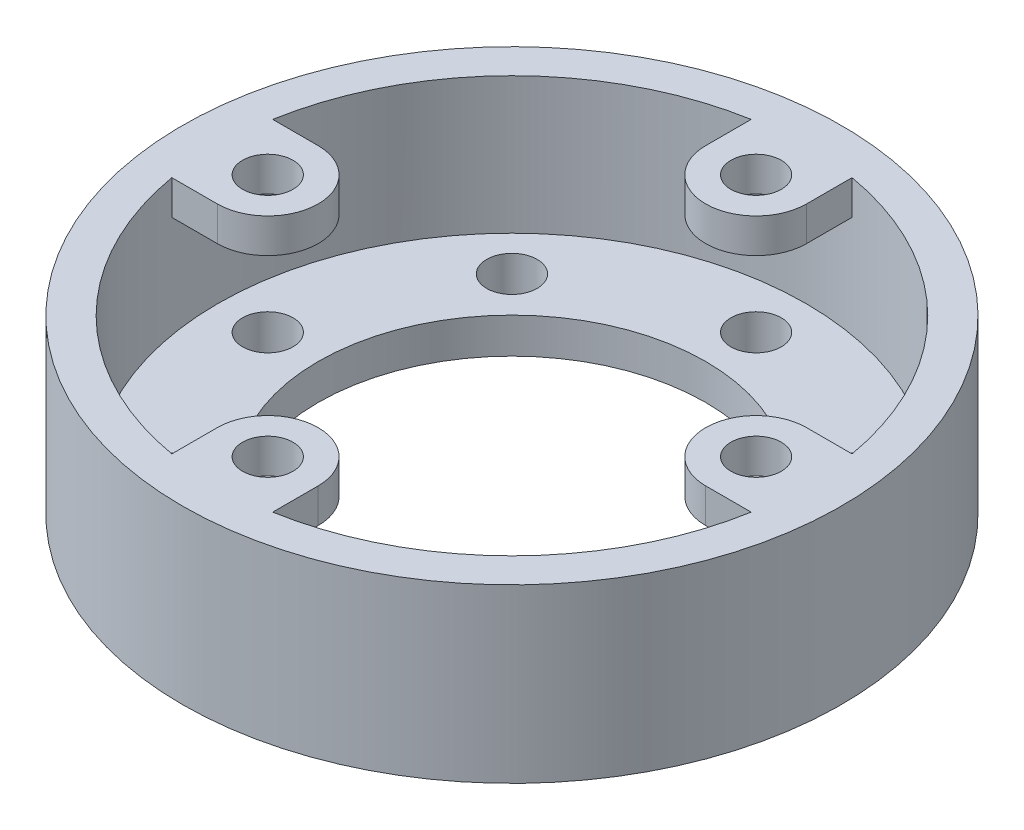
ISO-10303-21;
HEADER;
FILE_DESCRIPTION(('STEP AP214'),'2;1');
FILE_NAME('part.step','',(''),(''),'','','');
FILE_SCHEMA(('AUTOMOTIVE_DESIGN { 1 0 10303 214 1 1 1 1 }'));
ENDSEC;
DATA;
#1=APPLICATION_CONTEXT('core data for automotive mechanical design processes');
#2=APPLICATION_PROTOCOL_DEFINITION('international standard','automotive_design',2000,#1);
#3=PRODUCT_CONTEXT('',#1,'mechanical');
#4=PRODUCT('Part','Part','',(#3));
#5=PRODUCT_RELATED_PRODUCT_CATEGORY('part','',(#4));
#6=PRODUCT_DEFINITION_FORMATION('','',#4);
#7=PRODUCT_DEFINITION_CONTEXT('part definition',#1,'design');
#8=PRODUCT_DEFINITION('design','',#6,#7);
#9=PRODUCT_DEFINITION_SHAPE('','',#8);
#10=(LENGTH_UNIT() NAMED_UNIT(*) SI_UNIT(.MILLI.,.METRE.));
#11=(NAMED_UNIT(*) PLANE_ANGLE_UNIT() SI_UNIT($,.RADIAN.));
#12=(NAMED_UNIT(*) SI_UNIT($,.STERADIAN.) SOLID_ANGLE_UNIT());
#13=UNCERTAINTY_MEASURE_WITH_UNIT(LENGTH_MEASURE(1.E-05),#10,'distance_accuracy_value','');
#14=(GEOMETRIC_REPRESENTATION_CONTEXT(3) GLOBAL_UNCERTAINTY_ASSIGNED_CONTEXT((#13)) GLOBAL_UNIT_ASSIGNED_CONTEXT((#10,
#11,#12)) REPRESENTATION_CONTEXT('',''));
#15=CARTESIAN_POINT('',(0.,0.,0.));
#16=DIRECTION('',(0.,0.,1.));
#17=DIRECTION('',(1.,0.,0.));
#18=AXIS2_PLACEMENT_3D('',#15,#16,#17);
#19=CARTESIAN_POINT('',(0.,92.899450936045,0.));
#20=DIRECTION('',(0.,1.,0.));
#21=DIRECTION('',(0.,0.,1.));
#22=AXIS2_PLACEMENT_3D('',#19,#20,#21);
#23=CYLINDRICAL_SURFACE('',#22,65.151);
#24=DIRECTION('',(0.,1.,0.));
#25=VECTOR('',#24,1.);
#26=CARTESIAN_POINT('',(11.1759999999996,30.48,64.1852773227631));
#27=LINE('',#26,#25);
#28=CARTESIAN_POINT('',(11.1759999999996,30.48,64.1852773227631));
#29=VERTEX_POINT('',#28);
#30=CARTESIAN_POINT('',(11.1759999999996,38.1,64.1852773227631));
#31=VERTEX_POINT('',#30);
#32=EDGE_CURVE('E167',#29,#31,#27,.T.);
#33=ORIENTED_EDGE('',*,*,#32,.T.);
#34=CARTESIAN_POINT('',(0.,38.1,0.));
#35=DIRECTION('',(0.,1.,0.));
#36=DIRECTION('',(0.,0.,1.));
#37=AXIS2_PLACEMENT_3D('',#34,#35,#36);
#38=CIRCLE('',#37,65.151);
#39=CARTESIAN_POINT('',(64.185277322763,38.1,11.1760000000002));
#40=VERTEX_POINT('',#39);
#41=EDGE_CURVE('E355',#31,#40,#38,.T.);
#42=ORIENTED_EDGE('',*,*,#41,.T.);
#43=DIRECTION('',(0.,1.,0.));
#44=VECTOR('',#43,1.);
#45=CARTESIAN_POINT('',(64.185277322763,30.48,11.1760000000002));
#46=LINE('',#45,#44);
#47=CARTESIAN_POINT('',(64.185277322763,30.48,11.1760000000002));
#48=VERTEX_POINT('',#47);
#49=EDGE_CURVE('E218',#48,#40,#46,.T.);
#50=ORIENTED_EDGE('',*,*,#49,.F.);
#51=CARTESIAN_POINT('',(0.,30.48,0.));
#52=DIRECTION('',(0.,1.,0.));
#53=DIRECTION('',(0.,0.,1.));
#54=AXIS2_PLACEMENT_3D('',#51,#52,#53);
#55=CIRCLE('',#54,65.151);
#56=CARTESIAN_POINT('',(64.1852773227631,30.48,-11.1759999999998));
#57=VERTEX_POINT('',#56);
#58=EDGE_CURVE('E200',#57,#48,#55,.F.);
#59=ORIENTED_EDGE('',*,*,#58,.F.);
#60=DIRECTION('',(0.,1.,0.));
#61=VECTOR('',#60,1.);
#62=CARTESIAN_POINT('',(64.1852773227631,30.48,-11.1759999999998));
#63=LINE('',#62,#61);
#64=CARTESIAN_POINT('',(64.1852773227631,38.1,-11.1759999999998));
#65=VERTEX_POINT('',#64);
#66=EDGE_CURVE('E214',#57,#65,#63,.T.);
#67=ORIENTED_EDGE('',*,*,#66,.T.);
#68=CARTESIAN_POINT('',(11.176,38.1,-64.185277322763));
#69=VERTEX_POINT('',#68);
#70=EDGE_CURVE('E357',#65,#69,#38,.T.);
#71=ORIENTED_EDGE('',*,*,#70,.T.);
#72=DIRECTION('',(0.,1.,0.));
#73=VECTOR('',#72,1.);
#74=CARTESIAN_POINT('',(11.176,30.48,-64.185277322763));
#75=LINE('',#74,#73);
#76=CARTESIAN_POINT('',(11.176,30.48,-64.185277322763));
#77=VERTEX_POINT('',#76);
#78=EDGE_CURVE('E254',#77,#69,#75,.T.);
#79=ORIENTED_EDGE('',*,*,#78,.F.);
#80=CARTESIAN_POINT('',(0.,30.48,0.));
#81=DIRECTION('',(0.,1.,0.));
#82=DIRECTION('',(0.,0.,1.));
#83=AXIS2_PLACEMENT_3D('',#80,#81,#82);
#84=CIRCLE('',#83,65.151);
#85=CARTESIAN_POINT('',(-11.176,30.48,-64.185277322763));
#86=VERTEX_POINT('',#85);
#87=EDGE_CURVE('E236',#86,#77,#84,.F.);
#88=ORIENTED_EDGE('',*,*,#87,.F.);
#89=DIRECTION('',(0.,1.,0.));
#90=VECTOR('',#89,1.);
#91=CARTESIAN_POINT('',(-11.176,30.48,-64.185277322763));
#92=LINE('',#91,#90);
#93=CARTESIAN_POINT('',(-11.176,38.1,-64.185277322763));
#94=VERTEX_POINT('',#93);
#95=EDGE_CURVE('E250',#86,#94,#92,.T.);
#96=ORIENTED_EDGE('',*,*,#95,.T.);
#97=CARTESIAN_POINT('',(-64.1852773227629,38.1,-11.1760000000007));
#98=VERTEX_POINT('',#97);
#99=EDGE_CURVE('E354',#94,#98,#38,.T.);
#100=ORIENTED_EDGE('',*,*,#99,.T.);
#101=DIRECTION('',(0.,1.,0.));
#102=VECTOR('',#101,1.);
#103=CARTESIAN_POINT('',(-64.1852773227629,30.48,-11.1760000000007));
#104=LINE('',#103,#102);
#105=CARTESIAN_POINT('',(-64.1852773227629,30.48,-11.1760000000007));
#106=VERTEX_POINT('',#105);
#107=EDGE_CURVE('E290',#106,#98,#104,.T.);
#108=ORIENTED_EDGE('',*,*,#107,.F.);
#109=CARTESIAN_POINT('',(0.,30.48,0.));
#110=DIRECTION('',(0.,1.,0.));
#111=DIRECTION('',(0.,0.,1.));
#112=AXIS2_PLACEMENT_3D('',#109,#110,#111);
#113=CIRCLE('',#112,65.151);
#114=CARTESIAN_POINT('',(-64.1852773227631,30.48,11.1759999999993));
#115=VERTEX_POINT('',#114);
#116=EDGE_CURVE('E272',#115,#106,#113,.F.);
#117=ORIENTED_EDGE('',*,*,#116,.F.);
#118=DIRECTION('',(0.,1.,0.));
#119=VECTOR('',#118,1.);
#120=CARTESIAN_POINT('',(-64.1852773227631,30.48,11.1759999999993));
#121=LINE('',#120,#119);
#122=CARTESIAN_POINT('',(-64.1852773227631,38.1,11.1759999999993));
#123=VERTEX_POINT('',#122);
#124=EDGE_CURVE('E286',#115,#123,#121,.T.);
#125=ORIENTED_EDGE('',*,*,#124,.T.);
#126=CARTESIAN_POINT('',(-11.1760000000004,38.1,64.1852773227629));
#127=VERTEX_POINT('',#126);
#128=EDGE_CURVE('E42',#123,#127,#38,.T.);
#129=ORIENTED_EDGE('',*,*,#128,.T.);
#130=DIRECTION('',(0.,1.,0.));
#131=VECTOR('',#130,1.);
#132=CARTESIAN_POINT('',(-11.1760000000004,30.48,64.1852773227629));
#133=LINE('',#132,#131);
#134=CARTESIAN_POINT('',(-11.1760000000004,30.48,64.185277322763));
#135=VERTEX_POINT('',#134);
#136=EDGE_CURVE('E54',#135,#127,#133,.T.);
#137=ORIENTED_EDGE('',*,*,#136,.F.);
#138=CARTESIAN_POINT('',(0.,30.48,0.));
#139=DIRECTION('',(0.,1.,0.));
#140=DIRECTION('',(0.,0.,1.));
#141=AXIS2_PLACEMENT_3D('',#138,#139,#140);
#142=CIRCLE('',#141,65.151);
#143=EDGE_CURVE('E49',#29,#135,#142,.F.);
#144=ORIENTED_EDGE('',*,*,#143,.F.);
#145=EDGE_LOOP('',(#33,#42,#50,#59,#67,#71,#79,#88,#96,#100,#108,#117,#125,#129,#137,#144));
#146=FACE_BOUND('',#145,.T.);
#147=CARTESIAN_POINT('',(0.,7.87399999999999,0.));
#148=DIRECTION('',(0.,1.,0.));
#149=DIRECTION('',(0.,0.,1.));
#150=AXIS2_PLACEMENT_3D('',#147,#148,#149);
#151=CIRCLE('',#150,65.151);
#152=CARTESIAN_POINT('',(0.,7.87399999999999,65.151));
#153=VERTEX_POINT('',#152);
#154=EDGE_CURVE('E11',#153,#153,#151,.T.);
#155=ORIENTED_EDGE('',*,*,#154,.F.);
#156=EDGE_LOOP('',(#155));
#157=FACE_BOUND('',#156,.T.);
#158=ADVANCED_FACE('F35',(#146,#157),#23,.F.);
#159=CARTESIAN_POINT('',(-65.151,38.1,0.));
#160=DIRECTION('',(0.,1.,0.));
#161=DIRECTION('',(0.,0.,1.));
#162=AXIS2_PLACEMENT_3D('',#159,#160,#161);
#163=PLANE('',#162);
#164=CARTESIAN_POINT('',(0.,38.1,0.));
#165=DIRECTION('',(0.,1.,0.));
#166=DIRECTION('',(0.,0.,1.));
#167=AXIS2_PLACEMENT_3D('',#164,#165,#166);
#168=CIRCLE('',#167,73.025);
#169=CARTESIAN_POINT('',(0.,38.1,73.025));
#170=VERTEX_POINT('',#169);
#171=EDGE_CURVE('E352',#170,#170,#168,.T.);
#172=ORIENTED_EDGE('',*,*,#171,.T.);
#173=EDGE_LOOP('',(#172));
#174=FACE_BOUND('',#173,.T.);
#175=ORIENTED_EDGE('',*,*,#128,.F.);
#176=DIRECTION('',(1.,0.,0.));
#177=VECTOR('',#176,1.);
#178=CARTESIAN_POINT('',(-1.17285621109394E-13,38.1,11.176));
#179=LINE('',#178,#177);
#180=CARTESIAN_POINT('',(-54.1020000000001,38.1,11.1759999999994));
#181=VERTEX_POINT('',#180);
#182=EDGE_CURVE('E278',#123,#181,#179,.T.);
#183=ORIENTED_EDGE('',*,*,#182,.T.);
#184=CARTESIAN_POINT('',(-54.102,38.1,-5.66688370182274E-13));
#185=DIRECTION('',(0.,1.,0.));
#186=DIRECTION('',(0.,0.,1.));
#187=AXIS2_PLACEMENT_3D('',#184,#185,#186);
#188=CIRCLE('',#187,11.176);
#189=CARTESIAN_POINT('',(-54.1019999999999,38.1,-11.1760000000006));
#190=VERTEX_POINT('',#189);
#191=EDGE_CURVE('E281',#181,#190,#188,.T.);
#192=ORIENTED_EDGE('',*,*,#191,.T.);
#193=DIRECTION('',(1.,0.,0.));
#194=VECTOR('',#193,1.);
#195=CARTESIAN_POINT('',(1.17285621109394E-13,38.1,-11.176));
#196=LINE('',#195,#194);
#197=EDGE_CURVE('E264',#98,#190,#196,.T.);
#198=ORIENTED_EDGE('',*,*,#197,.F.);
#199=ORIENTED_EDGE('',*,*,#99,.F.);
#200=DIRECTION('',(0.,0.,1.));
#201=VECTOR('',#200,1.);
#202=CARTESIAN_POINT('',(-11.176,38.1,0.));
#203=LINE('',#202,#201);
#204=CARTESIAN_POINT('',(-11.176,38.1,-54.102));
#205=VERTEX_POINT('',#204);
#206=EDGE_CURVE('E242',#94,#205,#203,.T.);
#207=ORIENTED_EDGE('',*,*,#206,.T.);
#208=CARTESIAN_POINT('',(0.,38.1,-54.102));
#209=DIRECTION('',(0.,1.,0.));
#210=DIRECTION('',(0.,0.,1.));
#211=AXIS2_PLACEMENT_3D('',#208,#209,#210);
#212=CIRCLE('',#211,11.176);
#213=CARTESIAN_POINT('',(11.176,38.1,-54.102));
#214=VERTEX_POINT('',#213);
#215=EDGE_CURVE('E245',#205,#214,#212,.T.);
#216=ORIENTED_EDGE('',*,*,#215,.T.);
#217=DIRECTION('',(0.,0.,1.));
#218=VECTOR('',#217,1.);
#219=CARTESIAN_POINT('',(11.176,38.1,0.));
#220=LINE('',#219,#218);
#221=EDGE_CURVE('E228',#69,#214,#220,.T.);
#222=ORIENTED_EDGE('',*,*,#221,.F.);
#223=ORIENTED_EDGE('',*,*,#70,.F.);
#224=DIRECTION('',(-1.,0.,0.));
#225=VECTOR('',#224,1.);
#226=CARTESIAN_POINT('',(0.,38.1,-11.176));
#227=LINE('',#226,#225);
#228=CARTESIAN_POINT('',(54.1020000000001,38.1,-11.1759999999998));
#229=VERTEX_POINT('',#228);
#230=EDGE_CURVE('E206',#65,#229,#227,.T.);
#231=ORIENTED_EDGE('',*,*,#230,.T.);
#232=CARTESIAN_POINT('',(54.102,38.1,1.88896123394091E-13));
#233=DIRECTION('',(0.,1.,0.));
#234=DIRECTION('',(0.,0.,1.));
#235=AXIS2_PLACEMENT_3D('',#232,#233,#234);
#236=CIRCLE('',#235,11.176);
#237=CARTESIAN_POINT('',(54.102,38.1,11.1760000000002));
#238=VERTEX_POINT('',#237);
#239=EDGE_CURVE('E209',#229,#238,#236,.T.);
#240=ORIENTED_EDGE('',*,*,#239,.T.);
#241=DIRECTION('',(-1.,0.,0.));
#242=VECTOR('',#241,1.);
#243=CARTESIAN_POINT('',(0.,38.1,11.176));
#244=LINE('',#243,#242);
#245=EDGE_CURVE('E192',#40,#238,#244,.T.);
#246=ORIENTED_EDGE('',*,*,#245,.F.);
#247=ORIENTED_EDGE('',*,*,#41,.F.);
#248=DIRECTION('',(0.,0.,-1.));
#249=VECTOR('',#248,1.);
#250=CARTESIAN_POINT('',(11.176,38.1,0.));
#251=LINE('',#250,#249);
#252=CARTESIAN_POINT('',(11.1759999999996,38.1,54.1020000000001));
#253=VERTEX_POINT('',#252);
#254=EDGE_CURVE('E179',#31,#253,#251,.T.);
#255=ORIENTED_EDGE('',*,*,#254,.T.);
#256=CARTESIAN_POINT('',(-3.77792246788182E-13,38.1,54.102));
#257=DIRECTION('',(0.,1.,0.));
#258=DIRECTION('',(0.,0.,1.));
#259=AXIS2_PLACEMENT_3D('',#256,#257,#258);
#260=CIRCLE('',#259,11.176);
#261=CARTESIAN_POINT('',(-11.1760000000004,38.1,54.1019999999999));
#262=VERTEX_POINT('',#261);
#263=EDGE_CURVE('E152',#253,#262,#260,.T.);
#264=ORIENTED_EDGE('',*,*,#263,.T.);
#265=DIRECTION('',(0.,0.,-1.));
#266=VECTOR('',#265,1.);
#267=CARTESIAN_POINT('',(-11.176,38.1,0.));
#268=LINE('',#267,#266);
#269=EDGE_CURVE('E171',#127,#262,#268,.T.);
#270=ORIENTED_EDGE('',*,*,#269,.F.);
#271=EDGE_LOOP('',(#175,#183,#192,#198,#199,#207,#216,#222,#223,#231,#240,#246,#247,#255,#264,#270));
#272=FACE_BOUND('',#271,.T.);
#273=CARTESIAN_POINT('',(-54.102,38.1,-5.66688370182274E-13));
#274=DIRECTION('',(0.,1.,0.));
#275=DIRECTION('',(0.,0.,1.));
#276=AXIS2_PLACEMENT_3D('',#273,#274,#275);
#277=CIRCLE('',#276,5.588);
#278=CARTESIAN_POINT('',(-54.102,38.1,5.58799999999944));
#279=VERTEX_POINT('',#278);
#280=EDGE_CURVE('E253',#279,#279,#277,.T.);
#281=ORIENTED_EDGE('',*,*,#280,.F.);
#282=EDGE_LOOP('',(#281));
#283=FACE_BOUND('',#282,.T.);
#284=CARTESIAN_POINT('',(0.,38.1,-54.102));
#285=DIRECTION('',(0.,1.,0.));
#286=DIRECTION('',(0.,0.,1.));
#287=AXIS2_PLACEMENT_3D('',#284,#285,#286);
#288=CIRCLE('',#287,5.588);
#289=CARTESIAN_POINT('',(0.,38.1,-48.514));
#290=VERTEX_POINT('',#289);
#291=EDGE_CURVE('E217',#290,#290,#288,.T.);
#292=ORIENTED_EDGE('',*,*,#291,.F.);
#293=EDGE_LOOP('',(#292));
#294=FACE_BOUND('',#293,.T.);
#295=CARTESIAN_POINT('',(54.102,38.1,1.88896123394091E-13));
#296=DIRECTION('',(0.,1.,0.));
#297=DIRECTION('',(0.,0.,1.));
#298=AXIS2_PLACEMENT_3D('',#295,#296,#297);
#299=CIRCLE('',#298,5.588);
#300=CARTESIAN_POINT('',(54.102,38.1,5.58800000000019));
#301=VERTEX_POINT('',#300);
#302=EDGE_CURVE('E185',#301,#301,#299,.T.);
#303=ORIENTED_EDGE('',*,*,#302,.F.);
#304=EDGE_LOOP('',(#303));
#305=FACE_BOUND('',#304,.T.);
#306=CARTESIAN_POINT('',(-3.77792246788182E-13,38.1,54.102));
#307=DIRECTION('',(0.,1.,0.));
#308=DIRECTION('',(0.,0.,1.));
#309=AXIS2_PLACEMENT_3D('',#306,#307,#308);
#310=CIRCLE('',#309,5.588);
#311=CARTESIAN_POINT('',(-3.77792246788182E-13,38.1,59.69));
#312=VERTEX_POINT('',#311);
#313=EDGE_CURVE('E176',#312,#312,#310,.T.);
#314=ORIENTED_EDGE('',*,*,#313,.F.);
#315=EDGE_LOOP('',(#314));
#316=FACE_BOUND('',#315,.T.);
#317=ADVANCED_FACE('F365',(#174,#272,#283,#294,#305,#316),#163,.T.);
#318=CARTESIAN_POINT('',(0.,92.899450936045,0.));
#319=DIRECTION('',(0.,1.,0.));
#320=DIRECTION('',(0.,0.,1.));
#321=AXIS2_PLACEMENT_3D('',#318,#319,#320);
#322=CYLINDRICAL_SURFACE('',#321,73.025);
#323=CARTESIAN_POINT('',(0.,0.,0.));
#324=DIRECTION('',(0.,1.,0.));
#325=DIRECTION('',(0.,0.,1.));
#326=AXIS2_PLACEMENT_3D('',#323,#324,#325);
#327=CIRCLE('',#326,73.025);
#328=CARTESIAN_POINT('',(0.,0.,73.025));
#329=VERTEX_POINT('',#328);
#330=EDGE_CURVE('E347',#329,#329,#327,.T.);
#331=ORIENTED_EDGE('',*,*,#330,.T.);
#332=EDGE_LOOP('',(#331));
#333=FACE_BOUND('',#332,.T.);
#334=ORIENTED_EDGE('',*,*,#171,.F.);
#335=EDGE_LOOP('',(#334));
#336=FACE_BOUND('',#335,.T.);
#337=ADVANCED_FACE('F413',(#333,#336),#322,.T.);
#338=CARTESIAN_POINT('',(-65.151,0.,0.));
#339=DIRECTION('',(0.,-1.,0.));
#340=DIRECTION('',(0.,0.,-1.));
#341=AXIS2_PLACEMENT_3D('',#338,#339,#340);
#342=PLANE('',#341);
#343=CARTESIAN_POINT('',(0.,0.,-54.102));
#344=DIRECTION('',(0.,1.,0.));
#345=DIRECTION('',(0.,0.,1.));
#346=AXIS2_PLACEMENT_3D('',#343,#344,#345);
#347=CIRCLE('',#346,5.588);
#348=CARTESIAN_POINT('',(0.,0.,-48.514));
#349=VERTEX_POINT('',#348);
#350=EDGE_CURVE('E296',#349,#349,#347,.T.);
#351=ORIENTED_EDGE('',*,*,#350,.T.);
#352=EDGE_LOOP('',(#351));
#353=FACE_BOUND('',#352,.T.);
#354=CARTESIAN_POINT('',(38.2558910757547,0.,-38.2558910757545));
#355=DIRECTION('',(0.,1.,0.));
#356=DIRECTION('',(0.,0.,1.));
#357=AXIS2_PLACEMENT_3D('',#354,#355,#356);
#358=CIRCLE('',#357,5.58800000000001);
#359=CARTESIAN_POINT('',(38.2558910757547,0.,-32.6678910757545));
#360=VERTEX_POINT('',#359);
#361=EDGE_CURVE('E303',#360,#360,#358,.T.);
#362=ORIENTED_EDGE('',*,*,#361,.T.);
#363=EDGE_LOOP('',(#362));
#364=FACE_BOUND('',#363,.T.);
#365=CARTESIAN_POINT('',(54.102,0.,0.));
#366=DIRECTION('',(0.,1.,0.));
#367=DIRECTION('',(0.,0.,1.));
#368=AXIS2_PLACEMENT_3D('',#365,#366,#367);
#369=CIRCLE('',#368,5.58800000000016);
#370=CARTESIAN_POINT('',(54.102,0.,5.58800000000018));
#371=VERTEX_POINT('',#370);
#372=EDGE_CURVE('E309',#371,#371,#369,.T.);
#373=ORIENTED_EDGE('',*,*,#372,.T.);
#374=EDGE_LOOP('',(#373));
#375=FACE_BOUND('',#374,.T.);
#376=CARTESIAN_POINT('',(38.2558910757546,0.,38.2558910757546));
#377=DIRECTION('',(0.,1.,0.));
#378=DIRECTION('',(0.,0.,1.));
#379=AXIS2_PLACEMENT_3D('',#376,#377,#378);
#380=CIRCLE('',#379,5.58800000000023);
#381=CARTESIAN_POINT('',(38.2558910757546,0.,43.8438910757548));
#382=VERTEX_POINT('',#381);
#383=EDGE_CURVE('E315',#382,#382,#380,.T.);
#384=ORIENTED_EDGE('',*,*,#383,.T.);
#385=EDGE_LOOP('',(#384));
#386=FACE_BOUND('',#385,.T.);
#387=CARTESIAN_POINT('',(0.,0.,54.102));
#388=DIRECTION('',(0.,1.,0.));
#389=DIRECTION('',(0.,0.,1.));
#390=AXIS2_PLACEMENT_3D('',#387,#388,#389);
#391=CIRCLE('',#390,5.58800000000036);
#392=CARTESIAN_POINT('',(0.,0.,59.6900000000004));
#393=VERTEX_POINT('',#392);
#394=EDGE_CURVE('E321',#393,#393,#391,.T.);
#395=ORIENTED_EDGE('',*,*,#394,.T.);
#396=EDGE_LOOP('',(#395));
#397=FACE_BOUND('',#396,.T.);
#398=CARTESIAN_POINT('',(-38.2558910757546,0.,38.2558910757546));
#399=DIRECTION('',(0.,1.,0.));
#400=DIRECTION('',(0.,0.,1.));
#401=AXIS2_PLACEMENT_3D('',#398,#399,#400);
#402=CIRCLE('',#401,5.58800000000044);
#403=CARTESIAN_POINT('',(-38.2558910757546,0.,43.843891075755));
#404=VERTEX_POINT('',#403);
#405=EDGE_CURVE('E327',#404,#404,#402,.T.);
#406=ORIENTED_EDGE('',*,*,#405,.T.);
#407=EDGE_LOOP('',(#406));
#408=FACE_BOUND('',#407,.T.);
#409=CARTESIAN_POINT('',(-54.102,0.,0.));
#410=DIRECTION('',(0.,1.,0.));
#411=DIRECTION('',(0.,0.,1.));
#412=AXIS2_PLACEMENT_3D('',#409,#410,#411);
#413=CIRCLE('',#412,5.58800000000054);
#414=CARTESIAN_POINT('',(-54.102,0.,5.58800000000054));
#415=VERTEX_POINT('',#414);
#416=EDGE_CURVE('E333',#415,#415,#413,.T.);
#417=ORIENTED_EDGE('',*,*,#416,.T.);
#418=EDGE_LOOP('',(#417));
#419=FACE_BOUND('',#418,.T.);
#420=CARTESIAN_POINT('',(-38.2558910757542,0.,-38.2558910757535));
#421=DIRECTION('',(0.,1.,0.));
#422=DIRECTION('',(0.,0.,1.));
#423=AXIS2_PLACEMENT_3D('',#420,#421,#422);
#424=CIRCLE('',#423,5.58800000000138);
#425=CARTESIAN_POINT('',(-38.2558910757542,0.,-32.6678910757521));
#426=VERTEX_POINT('',#425);
#427=EDGE_CURVE('E339',#426,#426,#424,.T.);
#428=ORIENTED_EDGE('',*,*,#427,.T.);
#429=EDGE_LOOP('',(#428));
#430=FACE_BOUND('',#429,.T.);
#431=ORIENTED_EDGE('',*,*,#330,.F.);
#432=EDGE_LOOP('',(#431));
#433=FACE_BOUND('',#432,.T.);
#434=CARTESIAN_POINT('',(0.,0.,0.));
#435=DIRECTION('',(0.,1.,0.));
#436=DIRECTION('',(0.,0.,1.));
#437=AXIS2_PLACEMENT_3D('',#434,#435,#436);
#438=CIRCLE('',#437,42.926);
#439=CARTESIAN_POINT('',(0.,0.,42.926));
#440=VERTEX_POINT('',#439);
#441=EDGE_CURVE('E299',#440,#440,#438,.T.);
#442=ORIENTED_EDGE('',*,*,#441,.T.);
#443=EDGE_LOOP('',(#442));
#444=FACE_BOUND('',#443,.T.);
#445=ADVANCED_FACE('F418',(#353,#364,#375,#386,#397,#408,#419,#430,#433,#444),#342,.T.);
#446=CARTESIAN_POINT('',(0.,7.874,0.));
#447=DIRECTION('',(0.,1.,0.));
#448=DIRECTION('',(0.,0.,1.));
#449=AXIS2_PLACEMENT_3D('',#446,#447,#448);
#450=PLANE('',#449);
#451=CARTESIAN_POINT('',(0.,7.874,-54.102));
#452=DIRECTION('',(0.,1.,0.));
#453=DIRECTION('',(0.,0.,1.));
#454=AXIS2_PLACEMENT_3D('',#451,#452,#453);
#455=CIRCLE('',#454,5.588);
#456=CARTESIAN_POINT('',(0.,7.874,-48.514));
#457=VERTEX_POINT('',#456);
#458=EDGE_CURVE('E300',#457,#457,#455,.T.);
#459=ORIENTED_EDGE('',*,*,#458,.F.);
#460=EDGE_LOOP('',(#459));
#461=FACE_BOUND('',#460,.T.);
#462=CARTESIAN_POINT('',(38.2558910757547,7.874,-38.2558910757545));
#463=DIRECTION('',(0.,1.,0.));
#464=DIRECTION('',(0.,0.,1.));
#465=AXIS2_PLACEMENT_3D('',#462,#463,#464);
#466=CIRCLE('',#465,5.58800000000001);
#467=CARTESIAN_POINT('',(38.2558910757547,7.874,-32.6678910757545));
#468=VERTEX_POINT('',#467);
#469=EDGE_CURVE('E306',#468,#468,#466,.T.);
#470=ORIENTED_EDGE('',*,*,#469,.F.);
#471=EDGE_LOOP('',(#470));
#472=FACE_BOUND('',#471,.T.);
#473=CARTESIAN_POINT('',(54.102,7.874,0.));
#474=DIRECTION('',(0.,1.,0.));
#475=DIRECTION('',(0.,0.,1.));
#476=AXIS2_PLACEMENT_3D('',#473,#474,#475);
#477=CIRCLE('',#476,5.58800000000016);
#478=CARTESIAN_POINT('',(54.102,7.874,5.58800000000018));
#479=VERTEX_POINT('',#478);
#480=EDGE_CURVE('E312',#479,#479,#477,.T.);
#481=ORIENTED_EDGE('',*,*,#480,.F.);
#482=EDGE_LOOP('',(#481));
#483=FACE_BOUND('',#482,.T.);
#484=CARTESIAN_POINT('',(38.2558910757546,7.874,38.2558910757546));
#485=DIRECTION('',(0.,1.,0.));
#486=DIRECTION('',(0.,0.,1.));
#487=AXIS2_PLACEMENT_3D('',#484,#485,#486);
#488=CIRCLE('',#487,5.58800000000023);
#489=CARTESIAN_POINT('',(38.2558910757546,7.874,43.8438910757548));
#490=VERTEX_POINT('',#489);
#491=EDGE_CURVE('E318',#490,#490,#488,.T.);
#492=ORIENTED_EDGE('',*,*,#491,.F.);
#493=EDGE_LOOP('',(#492));
#494=FACE_BOUND('',#493,.T.);
#495=CARTESIAN_POINT('',(0.,7.874,54.102));
#496=DIRECTION('',(0.,1.,0.));
#497=DIRECTION('',(0.,0.,1.));
#498=AXIS2_PLACEMENT_3D('',#495,#496,#497);
#499=CIRCLE('',#498,5.58800000000036);
#500=CARTESIAN_POINT('',(0.,7.874,59.6900000000004));
#501=VERTEX_POINT('',#500);
#502=EDGE_CURVE('E324',#501,#501,#499,.T.);
#503=ORIENTED_EDGE('',*,*,#502,.F.);
#504=EDGE_LOOP('',(#503));
#505=FACE_BOUND('',#504,.T.);
#506=CARTESIAN_POINT('',(-38.2558910757546,7.874,38.2558910757546));
#507=DIRECTION('',(0.,1.,0.));
#508=DIRECTION('',(0.,0.,1.));
#509=AXIS2_PLACEMENT_3D('',#506,#507,#508);
#510=CIRCLE('',#509,5.58800000000044);
#511=CARTESIAN_POINT('',(-38.2558910757546,7.874,43.843891075755));
#512=VERTEX_POINT('',#511);
#513=EDGE_CURVE('E330',#512,#512,#510,.T.);
#514=ORIENTED_EDGE('',*,*,#513,.F.);
#515=EDGE_LOOP('',(#514));
#516=FACE_BOUND('',#515,.T.);
#517=CARTESIAN_POINT('',(-54.102,7.874,0.));
#518=DIRECTION('',(0.,1.,0.));
#519=DIRECTION('',(0.,0.,1.));
#520=AXIS2_PLACEMENT_3D('',#517,#518,#519);
#521=CIRCLE('',#520,5.58800000000054);
#522=CARTESIAN_POINT('',(-54.102,7.874,5.58800000000054));
#523=VERTEX_POINT('',#522);
#524=EDGE_CURVE('E336',#523,#523,#521,.T.);
#525=ORIENTED_EDGE('',*,*,#524,.F.);
#526=EDGE_LOOP('',(#525));
#527=FACE_BOUND('',#526,.T.);
#528=CARTESIAN_POINT('',(-38.2558910757542,7.874,-38.2558910757535));
#529=DIRECTION('',(0.,1.,0.));
#530=DIRECTION('',(0.,0.,1.));
#531=AXIS2_PLACEMENT_3D('',#528,#529,#530);
#532=CIRCLE('',#531,5.58800000000138);
#533=CARTESIAN_POINT('',(-38.2558910757542,7.874,-32.6678910757521));
#534=VERTEX_POINT('',#533);
#535=EDGE_CURVE('E289',#534,#534,#532,.T.);
#536=ORIENTED_EDGE('',*,*,#535,.F.);
#537=EDGE_LOOP('',(#536));
#538=FACE_BOUND('',#537,.T.);
#539=ORIENTED_EDGE('',*,*,#154,.T.);
#540=EDGE_LOOP('',(#539));
#541=FACE_BOUND('',#540,.T.);
#542=CARTESIAN_POINT('',(0.,7.874,0.));
#543=DIRECTION('',(0.,1.,0.));
#544=DIRECTION('',(0.,0.,1.));
#545=AXIS2_PLACEMENT_3D('',#542,#543,#544);
#546=CIRCLE('',#545,42.926);
#547=CARTESIAN_POINT('',(0.,7.874,42.926));
#548=VERTEX_POINT('',#547);
#549=EDGE_CURVE('E344',#548,#548,#546,.T.);
#550=ORIENTED_EDGE('',*,*,#549,.F.);
#551=EDGE_LOOP('',(#550));
#552=FACE_BOUND('',#551,.T.);
#553=ADVANCED_FACE('F424',(#461,#472,#483,#494,#505,#516,#527,#538,#541,#552),#450,.T.);
#554=CARTESIAN_POINT('',(0.,7.874,0.));
#555=DIRECTION('',(0.,-1.,0.));
#556=DIRECTION('',(0.,0.,-1.));
#557=AXIS2_PLACEMENT_3D('',#554,#555,#556);
#558=CYLINDRICAL_SURFACE('',#557,42.926);
#559=ORIENTED_EDGE('',*,*,#549,.T.);
#560=EDGE_LOOP('',(#559));
#561=FACE_BOUND('',#560,.T.);
#562=ORIENTED_EDGE('',*,*,#441,.F.);
#563=EDGE_LOOP('',(#562));
#564=FACE_BOUND('',#563,.T.);
#565=ADVANCED_FACE('F428',(#561,#564),#558,.F.);
#566=CARTESIAN_POINT('',(-38.2558910757542,0.,-38.2558910757535));
#567=DIRECTION('',(0.,1.,0.));
#568=DIRECTION('',(0.,0.,1.));
#569=AXIS2_PLACEMENT_3D('',#566,#567,#568);
#570=CYLINDRICAL_SURFACE('',#569,5.58800000000138);
#571=ORIENTED_EDGE('',*,*,#427,.F.);
#572=EDGE_LOOP('',(#571));
#573=FACE_BOUND('',#572,.T.);
#574=ORIENTED_EDGE('',*,*,#535,.T.);
#575=EDGE_LOOP('',(#574));
#576=FACE_BOUND('',#575,.T.);
#577=ADVANCED_FACE('F432',(#573,#576),#570,.F.);
#578=CARTESIAN_POINT('',(-54.102,0.,0.));
#579=DIRECTION('',(0.,1.,0.));
#580=DIRECTION('',(0.,0.,1.));
#581=AXIS2_PLACEMENT_3D('',#578,#579,#580);
#582=CYLINDRICAL_SURFACE('',#581,5.58800000000054);
#583=ORIENTED_EDGE('',*,*,#416,.F.);
#584=EDGE_LOOP('',(#583));
#585=FACE_BOUND('',#584,.T.);
#586=ORIENTED_EDGE('',*,*,#524,.T.);
#587=EDGE_LOOP('',(#586));
#588=FACE_BOUND('',#587,.T.);
#589=ADVANCED_FACE('F436',(#585,#588),#582,.F.);
#590=CARTESIAN_POINT('',(-38.2558910757546,0.,38.2558910757546));
#591=DIRECTION('',(0.,1.,0.));
#592=DIRECTION('',(0.,0.,1.));
#593=AXIS2_PLACEMENT_3D('',#590,#591,#592);
#594=CYLINDRICAL_SURFACE('',#593,5.58800000000044);
#595=ORIENTED_EDGE('',*,*,#405,.F.);
#596=EDGE_LOOP('',(#595));
#597=FACE_BOUND('',#596,.T.);
#598=ORIENTED_EDGE('',*,*,#513,.T.);
#599=EDGE_LOOP('',(#598));
#600=FACE_BOUND('',#599,.T.);
#601=ADVANCED_FACE('F440',(#597,#600),#594,.F.);
#602=CARTESIAN_POINT('',(0.,0.,54.102));
#603=DIRECTION('',(0.,1.,0.));
#604=DIRECTION('',(0.,0.,1.));
#605=AXIS2_PLACEMENT_3D('',#602,#603,#604);
#606=CYLINDRICAL_SURFACE('',#605,5.58800000000036);
#607=ORIENTED_EDGE('',*,*,#394,.F.);
#608=EDGE_LOOP('',(#607));
#609=FACE_BOUND('',#608,.T.);
#610=ORIENTED_EDGE('',*,*,#502,.T.);
#611=EDGE_LOOP('',(#610));
#612=FACE_BOUND('',#611,.T.);
#613=ADVANCED_FACE('F444',(#609,#612),#606,.F.);
#614=CARTESIAN_POINT('',(38.2558910757546,0.,38.2558910757546));
#615=DIRECTION('',(0.,1.,0.));
#616=DIRECTION('',(0.,0.,1.));
#617=AXIS2_PLACEMENT_3D('',#614,#615,#616);
#618=CYLINDRICAL_SURFACE('',#617,5.58800000000023);
#619=ORIENTED_EDGE('',*,*,#383,.F.);
#620=EDGE_LOOP('',(#619));
#621=FACE_BOUND('',#620,.T.);
#622=ORIENTED_EDGE('',*,*,#491,.T.);
#623=EDGE_LOOP('',(#622));
#624=FACE_BOUND('',#623,.T.);
#625=ADVANCED_FACE('F448',(#621,#624),#618,.F.);
#626=CARTESIAN_POINT('',(54.102,0.,0.));
#627=DIRECTION('',(0.,1.,0.));
#628=DIRECTION('',(0.,0.,1.));
#629=AXIS2_PLACEMENT_3D('',#626,#627,#628);
#630=CYLINDRICAL_SURFACE('',#629,5.58800000000016);
#631=ORIENTED_EDGE('',*,*,#372,.F.);
#632=EDGE_LOOP('',(#631));
#633=FACE_BOUND('',#632,.T.);
#634=ORIENTED_EDGE('',*,*,#480,.T.);
#635=EDGE_LOOP('',(#634));
#636=FACE_BOUND('',#635,.T.);
#637=ADVANCED_FACE('F452',(#633,#636),#630,.F.);
#638=CARTESIAN_POINT('',(38.2558910757547,0.,-38.2558910757545));
#639=DIRECTION('',(0.,1.,0.));
#640=DIRECTION('',(0.,0.,1.));
#641=AXIS2_PLACEMENT_3D('',#638,#639,#640);
#642=CYLINDRICAL_SURFACE('',#641,5.58800000000001);
#643=ORIENTED_EDGE('',*,*,#361,.F.);
#644=EDGE_LOOP('',(#643));
#645=FACE_BOUND('',#644,.T.);
#646=ORIENTED_EDGE('',*,*,#469,.T.);
#647=EDGE_LOOP('',(#646));
#648=FACE_BOUND('',#647,.T.);
#649=ADVANCED_FACE('F456',(#645,#648),#642,.F.);
#650=CARTESIAN_POINT('',(0.,0.,-54.102));
#651=DIRECTION('',(0.,1.,0.));
#652=DIRECTION('',(0.,0.,1.));
#653=AXIS2_PLACEMENT_3D('',#650,#651,#652);
#654=CYLINDRICAL_SURFACE('',#653,5.588);
#655=ORIENTED_EDGE('',*,*,#350,.F.);
#656=EDGE_LOOP('',(#655));
#657=FACE_BOUND('',#656,.T.);
#658=ORIENTED_EDGE('',*,*,#458,.T.);
#659=EDGE_LOOP('',(#658));
#660=FACE_BOUND('',#659,.T.);
#661=ADVANCED_FACE('F460',(#657,#660),#654,.F.);
#662=CARTESIAN_POINT('',(-1.17285621109394E-13,30.48,11.176));
#663=DIRECTION('',(0.,0.,1.));
#664=DIRECTION('',(1.,0.,0.));
#665=AXIS2_PLACEMENT_3D('',#662,#663,#664);
#666=PLANE('',#665);
#667=ORIENTED_EDGE('',*,*,#182,.F.);
#668=ORIENTED_EDGE('',*,*,#124,.F.);
#669=DIRECTION('',(1.,0.,0.));
#670=VECTOR('',#669,1.);
#671=CARTESIAN_POINT('',(-1.17285621109394E-13,30.48,11.176));
#672=LINE('',#671,#670);
#673=CARTESIAN_POINT('',(-54.1020000000001,30.48,11.1759999999994));
#674=VERTEX_POINT('',#673);
#675=EDGE_CURVE('E263',#115,#674,#672,.T.);
#676=ORIENTED_EDGE('',*,*,#675,.T.);
#677=DIRECTION('',(0.,1.,0.));
#678=VECTOR('',#677,1.);
#679=CARTESIAN_POINT('',(-54.1020000000001,30.48,11.1759999999994));
#680=LINE('',#679,#678);
#681=EDGE_CURVE('E275',#674,#181,#680,.T.);
#682=ORIENTED_EDGE('',*,*,#681,.T.);
#683=EDGE_LOOP('',(#667,#668,#676,#682));
#684=FACE_BOUND('',#683,.T.);
#685=ADVANCED_FACE('F389',(#684),#666,.T.);
#686=CARTESIAN_POINT('',(1.17285621109394E-13,30.48,-11.176));
#687=DIRECTION('',(0.,0.,1.));
#688=DIRECTION('',(1.,0.,0.));
#689=AXIS2_PLACEMENT_3D('',#686,#687,#688);
#690=PLANE('',#689);
#691=ORIENTED_EDGE('',*,*,#197,.T.);
#692=DIRECTION('',(0.,1.,0.));
#693=VECTOR('',#692,1.);
#694=CARTESIAN_POINT('',(-54.1019999999999,30.48,-11.1760000000006));
#695=LINE('',#694,#693);
#696=CARTESIAN_POINT('',(-54.1019999999999,30.48,-11.1760000000006));
#697=VERTEX_POINT('',#696);
#698=EDGE_CURVE('E293',#697,#190,#695,.T.);
#699=ORIENTED_EDGE('',*,*,#698,.F.);
#700=DIRECTION('',(1.,0.,0.));
#701=VECTOR('',#700,1.);
#702=CARTESIAN_POINT('',(1.17285621109394E-13,30.48,-11.176));
#703=LINE('',#702,#701);
#704=EDGE_CURVE('E270',#106,#697,#703,.T.);
#705=ORIENTED_EDGE('',*,*,#704,.F.);
#706=ORIENTED_EDGE('',*,*,#107,.T.);
#707=EDGE_LOOP('',(#691,#699,#705,#706));
#708=FACE_BOUND('',#707,.T.);
#709=ADVANCED_FACE('F383',(#708),#690,.F.);
#710=CARTESIAN_POINT('',(-54.102,30.48,-5.66688370182274E-13));
#711=DIRECTION('',(0.,1.,0.));
#712=DIRECTION('',(0.,0.,1.));
#713=AXIS2_PLACEMENT_3D('',#710,#711,#712);
#714=CYLINDRICAL_SURFACE('',#713,5.588);
#715=CARTESIAN_POINT('',(-54.102,30.48,-5.66688370182274E-13));
#716=DIRECTION('',(0.,1.,0.));
#717=DIRECTION('',(0.,0.,1.));
#718=AXIS2_PLACEMENT_3D('',#715,#716,#717);
#719=CIRCLE('',#718,5.588);
#720=CARTESIAN_POINT('',(-54.102,30.48,5.58799999999944));
#721=VERTEX_POINT('',#720);
#722=EDGE_CURVE('E260',#721,#721,#719,.T.);
#723=ORIENTED_EDGE('',*,*,#722,.F.);
#724=EDGE_LOOP('',(#723));
#725=FACE_BOUND('',#724,.T.);
#726=ORIENTED_EDGE('',*,*,#280,.T.);
#727=EDGE_LOOP('',(#726));
#728=FACE_BOUND('',#727,.T.);
#729=ADVANCED_FACE('F465',(#725,#728),#714,.F.);
#730=CARTESIAN_POINT('',(-54.102,30.48,-5.66688370182274E-13));
#731=DIRECTION('',(0.,1.,0.));
#732=DIRECTION('',(0.,0.,1.));
#733=AXIS2_PLACEMENT_3D('',#730,#731,#732);
#734=CYLINDRICAL_SURFACE('',#733,11.176);
#735=ORIENTED_EDGE('',*,*,#191,.F.);
#736=ORIENTED_EDGE('',*,*,#681,.F.);
#737=CARTESIAN_POINT('',(-54.102,30.48,-5.66688370182274E-13));
#738=DIRECTION('',(0.,1.,0.));
#739=DIRECTION('',(0.,0.,1.));
#740=AXIS2_PLACEMENT_3D('',#737,#738,#739);
#741=CIRCLE('',#740,11.176);
#742=EDGE_CURVE('E267',#674,#697,#741,.T.);
#743=ORIENTED_EDGE('',*,*,#742,.T.);
#744=ORIENTED_EDGE('',*,*,#698,.T.);
#745=EDGE_LOOP('',(#735,#736,#743,#744));
#746=FACE_BOUND('',#745,.T.);
#747=ADVANCED_FACE('F393',(#746),#734,.T.);
#748=CARTESIAN_POINT('',(0.,30.48,0.));
#749=DIRECTION('',(0.,1.,0.));
#750=DIRECTION('',(0.,0.,1.));
#751=AXIS2_PLACEMENT_3D('',#748,#749,#750);
#752=PLANE('',#751);
#753=ORIENTED_EDGE('',*,*,#722,.T.);
#754=EDGE_LOOP('',(#753));
#755=FACE_BOUND('',#754,.T.);
#756=ORIENTED_EDGE('',*,*,#675,.F.);
#757=ORIENTED_EDGE('',*,*,#116,.T.);
#758=ORIENTED_EDGE('',*,*,#704,.T.);
#759=ORIENTED_EDGE('',*,*,#742,.F.);
#760=EDGE_LOOP('',(#756,#757,#758,#759));
#761=FACE_BOUND('',#760,.T.);
#762=ADVANCED_FACE('F391',(#755,#761),#752,.F.);
#763=CARTESIAN_POINT('',(-11.176,30.48,0.));
#764=DIRECTION('',(-1.,0.,0.));
#765=DIRECTION('',(0.,0.,1.));
#766=AXIS2_PLACEMENT_3D('',#763,#764,#765);
#767=PLANE('',#766);
#768=ORIENTED_EDGE('',*,*,#206,.F.);
#769=ORIENTED_EDGE('',*,*,#95,.F.);
#770=DIRECTION('',(0.,0.,1.));
#771=VECTOR('',#770,1.);
#772=CARTESIAN_POINT('',(-11.176,30.48,0.));
#773=LINE('',#772,#771);
#774=CARTESIAN_POINT('',(-11.176,30.48,-54.102));
#775=VERTEX_POINT('',#774);
#776=EDGE_CURVE('E227',#86,#775,#773,.T.);
#777=ORIENTED_EDGE('',*,*,#776,.T.);
#778=DIRECTION('',(0.,1.,0.));
#779=VECTOR('',#778,1.);
#780=CARTESIAN_POINT('',(-11.176,30.48,-54.102));
#781=LINE('',#780,#779);
#782=EDGE_CURVE('E239',#775,#205,#781,.T.);
#783=ORIENTED_EDGE('',*,*,#782,.T.);
#784=EDGE_LOOP('',(#768,#769,#777,#783));
#785=FACE_BOUND('',#784,.T.);
#786=ADVANCED_FACE('F378',(#785),#767,.T.);
#787=CARTESIAN_POINT('',(11.176,30.48,0.));
#788=DIRECTION('',(-1.,0.,0.));
#789=DIRECTION('',(0.,0.,1.));
#790=AXIS2_PLACEMENT_3D('',#787,#788,#789);
#791=PLANE('',#790);
#792=ORIENTED_EDGE('',*,*,#221,.T.);
#793=DIRECTION('',(0.,1.,0.));
#794=VECTOR('',#793,1.);
#795=CARTESIAN_POINT('',(11.176,30.48,-54.102));
#796=LINE('',#795,#794);
#797=CARTESIAN_POINT('',(11.176,30.48,-54.102));
#798=VERTEX_POINT('',#797);
#799=EDGE_CURVE('E257',#798,#214,#796,.T.);
#800=ORIENTED_EDGE('',*,*,#799,.F.);
#801=DIRECTION('',(0.,0.,1.));
#802=VECTOR('',#801,1.);
#803=CARTESIAN_POINT('',(11.176,30.48,0.));
#804=LINE('',#803,#802);
#805=EDGE_CURVE('E234',#77,#798,#804,.T.);
#806=ORIENTED_EDGE('',*,*,#805,.F.);
#807=ORIENTED_EDGE('',*,*,#78,.T.);
#808=EDGE_LOOP('',(#792,#800,#806,#807));
#809=FACE_BOUND('',#808,.T.);
#810=ADVANCED_FACE('F370',(#809),#791,.F.);
#811=CARTESIAN_POINT('',(0.,30.48,-54.102));
#812=DIRECTION('',(0.,1.,0.));
#813=DIRECTION('',(0.,0.,1.));
#814=AXIS2_PLACEMENT_3D('',#811,#812,#813);
#815=CYLINDRICAL_SURFACE('',#814,5.588);
#816=CARTESIAN_POINT('',(0.,30.48,-54.102));
#817=DIRECTION('',(0.,1.,0.));
#818=DIRECTION('',(0.,0.,1.));
#819=AXIS2_PLACEMENT_3D('',#816,#817,#818);
#820=CIRCLE('',#819,5.588);
#821=CARTESIAN_POINT('',(0.,30.48,-48.514));
#822=VERTEX_POINT('',#821);
#823=EDGE_CURVE('E224',#822,#822,#820,.T.);
#824=ORIENTED_EDGE('',*,*,#823,.F.);
#825=EDGE_LOOP('',(#824));
#826=FACE_BOUND('',#825,.T.);
#827=ORIENTED_EDGE('',*,*,#291,.T.);
#828=EDGE_LOOP('',(#827));
#829=FACE_BOUND('',#828,.T.);
#830=ADVANCED_FACE('F478',(#826,#829),#815,.F.);
#831=CARTESIAN_POINT('',(0.,30.48,-54.102));
#832=DIRECTION('',(0.,1.,0.));
#833=DIRECTION('',(0.,0.,1.));
#834=AXIS2_PLACEMENT_3D('',#831,#832,#833);
#835=CYLINDRICAL_SURFACE('',#834,11.176);
#836=ORIENTED_EDGE('',*,*,#215,.F.);
#837=ORIENTED_EDGE('',*,*,#782,.F.);
#838=CARTESIAN_POINT('',(0.,30.48,-54.102));
#839=DIRECTION('',(0.,1.,0.));
#840=DIRECTION('',(0.,0.,1.));
#841=AXIS2_PLACEMENT_3D('',#838,#839,#840);
#842=CIRCLE('',#841,11.176);
#843=EDGE_CURVE('E231',#775,#798,#842,.T.);
#844=ORIENTED_EDGE('',*,*,#843,.T.);
#845=ORIENTED_EDGE('',*,*,#799,.T.);
#846=EDGE_LOOP('',(#836,#837,#844,#845));
#847=FACE_BOUND('',#846,.T.);
#848=ADVANCED_FACE('F481',(#847),#835,.T.);
#849=CARTESIAN_POINT('',(0.,30.48,0.));
#850=DIRECTION('',(0.,1.,0.));
#851=DIRECTION('',(0.,0.,1.));
#852=AXIS2_PLACEMENT_3D('',#849,#850,#851);
#853=PLANE('',#852);
#854=ORIENTED_EDGE('',*,*,#823,.T.);
#855=EDGE_LOOP('',(#854));
#856=FACE_BOUND('',#855,.T.);
#857=ORIENTED_EDGE('',*,*,#776,.F.);
#858=ORIENTED_EDGE('',*,*,#87,.T.);
#859=ORIENTED_EDGE('',*,*,#805,.T.);
#860=ORIENTED_EDGE('',*,*,#843,.F.);
#861=EDGE_LOOP('',(#857,#858,#859,#860));
#862=FACE_BOUND('',#861,.T.);
#863=ADVANCED_FACE('F374',(#856,#862),#853,.F.);
#864=CARTESIAN_POINT('',(0.,30.48,-11.176));
#865=DIRECTION('',(0.,0.,-1.));
#866=DIRECTION('',(-1.,0.,0.));
#867=AXIS2_PLACEMENT_3D('',#864,#865,#866);
#868=PLANE('',#867);
#869=ORIENTED_EDGE('',*,*,#230,.F.);
#870=ORIENTED_EDGE('',*,*,#66,.F.);
#871=DIRECTION('',(-1.,0.,0.));
#872=VECTOR('',#871,1.);
#873=CARTESIAN_POINT('',(0.,30.48,-11.176));
#874=LINE('',#873,#872);
#875=CARTESIAN_POINT('',(54.1020000000001,30.48,-11.1759999999998));
#876=VERTEX_POINT('',#875);
#877=EDGE_CURVE('E191',#57,#876,#874,.T.);
#878=ORIENTED_EDGE('',*,*,#877,.T.);
#879=DIRECTION('',(0.,1.,0.));
#880=VECTOR('',#879,1.);
#881=CARTESIAN_POINT('',(54.1020000000001,30.48,-11.1759999999998));
#882=LINE('',#881,#880);
#883=EDGE_CURVE('E203',#876,#229,#882,.T.);
#884=ORIENTED_EDGE('',*,*,#883,.T.);
#885=EDGE_LOOP('',(#869,#870,#878,#884));
#886=FACE_BOUND('',#885,.T.);
#887=ADVANCED_FACE('F492',(#886),#868,.T.);
#888=CARTESIAN_POINT('',(0.,30.48,11.176));
#889=DIRECTION('',(0.,0.,-1.));
#890=DIRECTION('',(-1.,0.,0.));
#891=AXIS2_PLACEMENT_3D('',#888,#889,#890);
#892=PLANE('',#891);
#893=ORIENTED_EDGE('',*,*,#245,.T.);
#894=DIRECTION('',(0.,1.,0.));
#895=VECTOR('',#894,1.);
#896=CARTESIAN_POINT('',(54.102,30.48,11.1760000000002));
#897=LINE('',#896,#895);
#898=CARTESIAN_POINT('',(54.102,30.48,11.1760000000002));
#899=VERTEX_POINT('',#898);
#900=EDGE_CURVE('E221',#899,#238,#897,.T.);
#901=ORIENTED_EDGE('',*,*,#900,.F.);
#902=DIRECTION('',(-1.,0.,0.));
#903=VECTOR('',#902,1.);
#904=CARTESIAN_POINT('',(0.,30.48,11.176));
#905=LINE('',#904,#903);
#906=EDGE_CURVE('E198',#48,#899,#905,.T.);
#907=ORIENTED_EDGE('',*,*,#906,.F.);
#908=ORIENTED_EDGE('',*,*,#49,.T.);
#909=EDGE_LOOP('',(#893,#901,#907,#908));
#910=FACE_BOUND('',#909,.T.);
#911=ADVANCED_FACE('F498',(#910),#892,.F.);
#912=CARTESIAN_POINT('',(54.102,30.48,1.88896123394091E-13));
#913=DIRECTION('',(0.,1.,0.));
#914=DIRECTION('',(0.,0.,1.));
#915=AXIS2_PLACEMENT_3D('',#912,#913,#914);
#916=CYLINDRICAL_SURFACE('',#915,5.588);
#917=CARTESIAN_POINT('',(54.102,30.48,1.88896123394091E-13));
#918=DIRECTION('',(0.,1.,0.));
#919=DIRECTION('',(0.,0.,1.));
#920=AXIS2_PLACEMENT_3D('',#917,#918,#919);
#921=CIRCLE('',#920,5.588);
#922=CARTESIAN_POINT('',(54.102,30.48,5.58800000000019));
#923=VERTEX_POINT('',#922);
#924=EDGE_CURVE('E188',#923,#923,#921,.T.);
#925=ORIENTED_EDGE('',*,*,#924,.F.);
#926=EDGE_LOOP('',(#925));
#927=FACE_BOUND('',#926,.T.);
#928=ORIENTED_EDGE('',*,*,#302,.T.);
#929=EDGE_LOOP('',(#928));
#930=FACE_BOUND('',#929,.T.);
#931=ADVANCED_FACE('F494',(#927,#930),#916,.F.);
#932=CARTESIAN_POINT('',(54.102,30.48,1.88896123394091E-13));
#933=DIRECTION('',(0.,1.,0.));
#934=DIRECTION('',(0.,0.,1.));
#935=AXIS2_PLACEMENT_3D('',#932,#933,#934);
#936=CYLINDRICAL_SURFACE('',#935,11.176);
#937=ORIENTED_EDGE('',*,*,#239,.F.);
#938=ORIENTED_EDGE('',*,*,#883,.F.);
#939=CARTESIAN_POINT('',(54.102,30.48,1.88896123394091E-13));
#940=DIRECTION('',(0.,1.,0.));
#941=DIRECTION('',(0.,0.,1.));
#942=AXIS2_PLACEMENT_3D('',#939,#940,#941);
#943=CIRCLE('',#942,11.176);
#944=EDGE_CURVE('E195',#876,#899,#943,.T.);
#945=ORIENTED_EDGE('',*,*,#944,.T.);
#946=ORIENTED_EDGE('',*,*,#900,.T.);
#947=EDGE_LOOP('',(#937,#938,#945,#946));
#948=FACE_BOUND('',#947,.T.);
#949=ADVANCED_FACE('F497',(#948),#936,.T.);
#950=CARTESIAN_POINT('',(0.,30.48,0.));
#951=DIRECTION('',(0.,1.,0.));
#952=DIRECTION('',(0.,0.,1.));
#953=AXIS2_PLACEMENT_3D('',#950,#951,#952);
#954=PLANE('',#953);
#955=ORIENTED_EDGE('',*,*,#924,.T.);
#956=EDGE_LOOP('',(#955));
#957=FACE_BOUND('',#956,.T.);
#958=ORIENTED_EDGE('',*,*,#877,.F.);
#959=ORIENTED_EDGE('',*,*,#58,.T.);
#960=ORIENTED_EDGE('',*,*,#906,.T.);
#961=ORIENTED_EDGE('',*,*,#944,.F.);
#962=EDGE_LOOP('',(#958,#959,#960,#961));
#963=FACE_BOUND('',#962,.T.);
#964=ADVANCED_FACE('F405',(#957,#963),#954,.F.);
#965=CARTESIAN_POINT('',(11.176,30.48,0.));
#966=DIRECTION('',(1.,0.,0.));
#967=DIRECTION('',(0.,0.,-1.));
#968=AXIS2_PLACEMENT_3D('',#965,#966,#967);
#969=PLANE('',#968);
#970=ORIENTED_EDGE('',*,*,#254,.F.);
#971=ORIENTED_EDGE('',*,*,#32,.F.);
#972=DIRECTION('',(0.,0.,-1.));
#973=VECTOR('',#972,1.);
#974=CARTESIAN_POINT('',(11.176,30.48,0.));
#975=LINE('',#974,#973);
#976=CARTESIAN_POINT('',(11.1759999999996,30.48,54.1020000000001));
#977=VERTEX_POINT('',#976);
#978=EDGE_CURVE('E162',#29,#977,#975,.T.);
#979=ORIENTED_EDGE('',*,*,#978,.T.);
#980=DIRECTION('',(0.,1.,0.));
#981=VECTOR('',#980,1.);
#982=CARTESIAN_POINT('',(11.1759999999996,30.48,54.1020000000001));
#983=LINE('',#982,#981);
#984=EDGE_CURVE('E147',#977,#253,#983,.T.);
#985=ORIENTED_EDGE('',*,*,#984,.T.);
#986=EDGE_LOOP('',(#970,#971,#979,#985));
#987=FACE_BOUND('',#986,.T.);
#988=ADVANCED_FACE('F166',(#987),#969,.T.);
#989=CARTESIAN_POINT('',(-11.176,30.48,0.));
#990=DIRECTION('',(1.,0.,0.));
#991=DIRECTION('',(0.,0.,-1.));
#992=AXIS2_PLACEMENT_3D('',#989,#990,#991);
#993=PLANE('',#992);
#994=ORIENTED_EDGE('',*,*,#269,.T.);
#995=DIRECTION('',(0.,1.,0.));
#996=VECTOR('',#995,1.);
#997=CARTESIAN_POINT('',(-11.1760000000004,30.48,54.1019999999999));
#998=LINE('',#997,#996);
#999=CARTESIAN_POINT('',(-11.1760000000004,30.48,54.1019999999999));
#1000=VERTEX_POINT('',#999);
#1001=EDGE_CURVE('E157',#1000,#262,#998,.T.);
#1002=ORIENTED_EDGE('',*,*,#1001,.F.);
#1003=DIRECTION('',(0.,0.,-1.));
#1004=VECTOR('',#1003,1.);
#1005=CARTESIAN_POINT('',(-11.176,30.48,0.));
#1006=LINE('',#1005,#1004);
#1007=EDGE_CURVE('E163',#135,#1000,#1006,.T.);
#1008=ORIENTED_EDGE('',*,*,#1007,.F.);
#1009=ORIENTED_EDGE('',*,*,#136,.T.);
#1010=EDGE_LOOP('',(#994,#1002,#1008,#1009));
#1011=FACE_BOUND('',#1010,.T.);
#1012=ADVANCED_FACE('F395',(#1011),#993,.F.);
#1013=CARTESIAN_POINT('',(-3.77792246788182E-13,30.48,54.102));
#1014=DIRECTION('',(0.,1.,0.));
#1015=DIRECTION('',(0.,0.,1.));
#1016=AXIS2_PLACEMENT_3D('',#1013,#1014,#1015);
#1017=CYLINDRICAL_SURFACE('',#1016,5.588);
#1018=CARTESIAN_POINT('',(-3.77792246788182E-13,30.48,54.102));
#1019=DIRECTION('',(0.,1.,0.));
#1020=DIRECTION('',(0.,0.,1.));
#1021=AXIS2_PLACEMENT_3D('',#1018,#1019,#1020);
#1022=CIRCLE('',#1021,5.588);
#1023=CARTESIAN_POINT('',(-3.77792246788182E-13,30.48,59.69));
#1024=VERTEX_POINT('',#1023);
#1025=EDGE_CURVE('E168',#1024,#1024,#1022,.T.);
#1026=ORIENTED_EDGE('',*,*,#1025,.F.);
#1027=EDGE_LOOP('',(#1026));
#1028=FACE_BOUND('',#1027,.T.);
#1029=ORIENTED_EDGE('',*,*,#313,.T.);
#1030=EDGE_LOOP('',(#1029));
#1031=FACE_BOUND('',#1030,.T.);
#1032=ADVANCED_FACE('F397',(#1028,#1031),#1017,.F.);
#1033=CARTESIAN_POINT('',(-3.77792246788182E-13,30.48,54.102));
#1034=DIRECTION('',(0.,1.,0.));
#1035=DIRECTION('',(0.,0.,1.));
#1036=AXIS2_PLACEMENT_3D('',#1033,#1034,#1035);
#1037=CYLINDRICAL_SURFACE('',#1036,11.176);
#1038=ORIENTED_EDGE('',*,*,#263,.F.);
#1039=ORIENTED_EDGE('',*,*,#984,.F.);
#1040=CARTESIAN_POINT('',(-3.77792246788182E-13,30.48,54.102));
#1041=DIRECTION('',(0.,1.,0.));
#1042=DIRECTION('',(0.,0.,1.));
#1043=AXIS2_PLACEMENT_3D('',#1040,#1041,#1042);
#1044=CIRCLE('',#1043,11.176);
#1045=EDGE_CURVE('E150',#977,#1000,#1044,.T.);
#1046=ORIENTED_EDGE('',*,*,#1045,.T.);
#1047=ORIENTED_EDGE('',*,*,#1001,.T.);
#1048=EDGE_LOOP('',(#1038,#1039,#1046,#1047));
#1049=FACE_BOUND('',#1048,.T.);
#1050=ADVANCED_FACE('F149',(#1049),#1037,.T.);
#1051=CARTESIAN_POINT('',(0.,30.48,0.));
#1052=DIRECTION('',(0.,1.,0.));
#1053=DIRECTION('',(0.,0.,1.));
#1054=AXIS2_PLACEMENT_3D('',#1051,#1052,#1053);
#1055=PLANE('',#1054);
#1056=ORIENTED_EDGE('',*,*,#1025,.T.);
#1057=EDGE_LOOP('',(#1056));
#1058=FACE_BOUND('',#1057,.T.);
#1059=ORIENTED_EDGE('',*,*,#978,.F.);
#1060=ORIENTED_EDGE('',*,*,#143,.T.);
#1061=ORIENTED_EDGE('',*,*,#1007,.T.);
#1062=ORIENTED_EDGE('',*,*,#1045,.F.);
#1063=EDGE_LOOP('',(#1059,#1060,#1061,#1062));
#1064=FACE_BOUND('',#1063,.T.);
#1065=ADVANCED_FACE('F161',(#1058,#1064),#1055,.F.);
#1066=CLOSED_SHELL('',(#158,#317,#337,#445,#553,#565,#577,#589,#601,#613,#625,#637,#649,#661,
#685,#709,#729,#747,#762,#786,#810,#830,#848,#863,#887,#911,#931,#949,#964,#988,#1012,#1032,
#1050,#1065));
#1067=MANIFOLD_SOLID_BREP('B2',#1066);
#1068=ADVANCED_BREP_SHAPE_REPRESENTATION('',(#18,#1067),#14);
#1069=SHAPE_DEFINITION_REPRESENTATION(#9,#1068);
ENDSEC;
END-ISO-10303-21;
